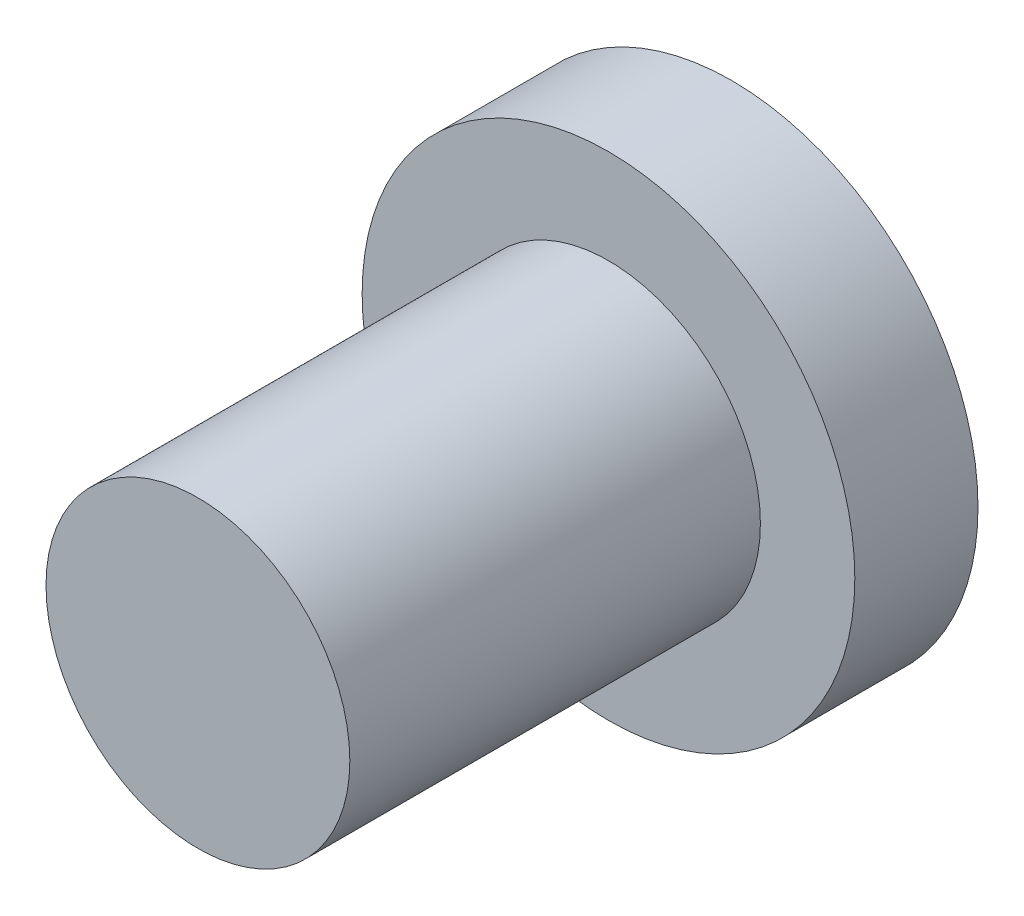
ISO-10303-21;
HEADER;
FILE_DESCRIPTION(('STEP AP214'),'2;1');
FILE_NAME('part.step','',(''),(''),'','','');
FILE_SCHEMA(('AUTOMOTIVE_DESIGN { 1 0 10303 214 1 1 1 1 }'));
ENDSEC;
DATA;
#1=APPLICATION_CONTEXT('core data for automotive mechanical design processes');
#2=APPLICATION_PROTOCOL_DEFINITION('international standard','automotive_design',2000,#1);
#3=PRODUCT_CONTEXT('',#1,'mechanical');
#4=PRODUCT('Part','Part','',(#3));
#5=PRODUCT_RELATED_PRODUCT_CATEGORY('part','',(#4));
#6=PRODUCT_DEFINITION_FORMATION('','',#4);
#7=PRODUCT_DEFINITION_CONTEXT('part definition',#1,'design');
#8=PRODUCT_DEFINITION('design','',#6,#7);
#9=PRODUCT_DEFINITION_SHAPE('','',#8);
#10=(LENGTH_UNIT() NAMED_UNIT(*) SI_UNIT(.MILLI.,.METRE.));
#11=(NAMED_UNIT(*) PLANE_ANGLE_UNIT() SI_UNIT($,.RADIAN.));
#12=(NAMED_UNIT(*) SI_UNIT($,.STERADIAN.) SOLID_ANGLE_UNIT());
#13=UNCERTAINTY_MEASURE_WITH_UNIT(LENGTH_MEASURE(1.E-05),#10,'distance_accuracy_value','');
#14=(GEOMETRIC_REPRESENTATION_CONTEXT(3) GLOBAL_UNCERTAINTY_ASSIGNED_CONTEXT((#13)) GLOBAL_UNIT_ASSIGNED_CONTEXT((#10,
#11,#12)) REPRESENTATION_CONTEXT('',''));
#15=CARTESIAN_POINT('',(0.,0.,0.));
#16=DIRECTION('',(0.,0.,1.));
#17=DIRECTION('',(1.,0.,0.));
#18=AXIS2_PLACEMENT_3D('',#15,#16,#17);
#19=CARTESIAN_POINT('',(0.,0.,1.5));
#20=DIRECTION('',(0.,0.,-1.));
#21=DIRECTION('',(-1.,0.,0.));
#22=AXIS2_PLACEMENT_3D('',#19,#20,#21);
#23=CYLINDRICAL_SURFACE('',#22,6.);
#24=CARTESIAN_POINT('',(0.,0.,1.5));
#25=DIRECTION('',(0.,0.,1.));
#26=DIRECTION('',(1.,0.,0.));
#27=AXIS2_PLACEMENT_3D('',#24,#25,#26);
#28=CIRCLE('',#27,6.);
#29=CARTESIAN_POINT('',(6.,0.,1.5));
#30=VERTEX_POINT('',#29);
#31=EDGE_CURVE('E10',#30,#30,#28,.T.);
#32=ORIENTED_EDGE('',*,*,#31,.F.);
#33=EDGE_LOOP('',(#32));
#34=FACE_BOUND('',#33,.T.);
#35=CARTESIAN_POINT('',(0.,0.,-1.5));
#36=DIRECTION('',(0.,0.,1.));
#37=DIRECTION('',(1.,0.,0.));
#38=AXIS2_PLACEMENT_3D('',#35,#36,#37);
#39=CIRCLE('',#38,6.);
#40=CARTESIAN_POINT('',(6.,0.,-1.5));
#41=VERTEX_POINT('',#40);
#42=EDGE_CURVE('E34',#41,#41,#39,.T.);
#43=ORIENTED_EDGE('',*,*,#42,.T.);
#44=EDGE_LOOP('',(#43));
#45=FACE_BOUND('',#44,.T.);
#46=ADVANCED_FACE('F31',(#34,#45),#23,.T.);
#47=CARTESIAN_POINT('',(0.,0.,1.5));
#48=DIRECTION('',(0.,0.,1.));
#49=DIRECTION('',(1.,0.,0.));
#50=AXIS2_PLACEMENT_3D('',#47,#48,#49);
#51=PLANE('',#50);
#52=CARTESIAN_POINT('',(0.,0.,1.5));
#53=DIRECTION('',(0.,0.,1.));
#54=DIRECTION('',(1.,0.,0.));
#55=AXIS2_PLACEMENT_3D('',#52,#53,#54);
#56=CIRCLE('',#55,3.7);
#57=CARTESIAN_POINT('',(3.7,0.,1.5));
#58=VERTEX_POINT('',#57);
#59=EDGE_CURVE('E43',#58,#58,#56,.T.);
#60=ORIENTED_EDGE('',*,*,#59,.F.);
#61=EDGE_LOOP('',(#60));
#62=FACE_BOUND('',#61,.T.);
#63=ORIENTED_EDGE('',*,*,#31,.T.);
#64=EDGE_LOOP('',(#63));
#65=FACE_BOUND('',#64,.T.);
#66=ADVANCED_FACE('F58',(#62,#65),#51,.T.);
#67=CARTESIAN_POINT('',(0.,0.,-1.5));
#68=DIRECTION('',(0.,0.,1.));
#69=DIRECTION('',(1.,0.,0.));
#70=AXIS2_PLACEMENT_3D('',#67,#68,#69);
#71=PLANE('',#70);
#72=ORIENTED_EDGE('',*,*,#42,.F.);
#73=EDGE_LOOP('',(#72));
#74=FACE_BOUND('',#73,.T.);
#75=ADVANCED_FACE('F54',(#74),#71,.F.);
#76=CARTESIAN_POINT('',(0.,0.,11.5));
#77=DIRECTION('',(0.,0.,-1.));
#78=DIRECTION('',(-1.,0.,0.));
#79=AXIS2_PLACEMENT_3D('',#76,#77,#78);
#80=CYLINDRICAL_SURFACE('',#79,3.7);
#81=CARTESIAN_POINT('',(0.,0.,11.5));
#82=DIRECTION('',(0.,0.,1.));
#83=DIRECTION('',(1.,0.,0.));
#84=AXIS2_PLACEMENT_3D('',#81,#82,#83);
#85=CIRCLE('',#84,3.7);
#86=CARTESIAN_POINT('',(3.7,0.,11.5));
#87=VERTEX_POINT('',#86);
#88=EDGE_CURVE('E41',#87,#87,#85,.T.);
#89=ORIENTED_EDGE('',*,*,#88,.F.);
#90=EDGE_LOOP('',(#89));
#91=FACE_BOUND('',#90,.T.);
#92=ORIENTED_EDGE('',*,*,#59,.T.);
#93=EDGE_LOOP('',(#92));
#94=FACE_BOUND('',#93,.T.);
#95=ADVANCED_FACE('F51',(#91,#94),#80,.T.);
#96=CARTESIAN_POINT('',(0.,0.,11.5));
#97=DIRECTION('',(0.,0.,1.));
#98=DIRECTION('',(1.,0.,0.));
#99=AXIS2_PLACEMENT_3D('',#96,#97,#98);
#100=PLANE('',#99);
#101=ORIENTED_EDGE('',*,*,#88,.T.);
#102=EDGE_LOOP('',(#101));
#103=FACE_BOUND('',#102,.T.);
#104=ADVANCED_FACE('F49',(#103),#100,.T.);
#105=CLOSED_SHELL('',(#46,#66,#75,#95,#104));
#106=MANIFOLD_SOLID_BREP('B2',#105);
#107=ADVANCED_BREP_SHAPE_REPRESENTATION('',(#18,#106),#14);
#108=SHAPE_DEFINITION_REPRESENTATION(#9,#107);
ENDSEC;
END-ISO-10303-21;
